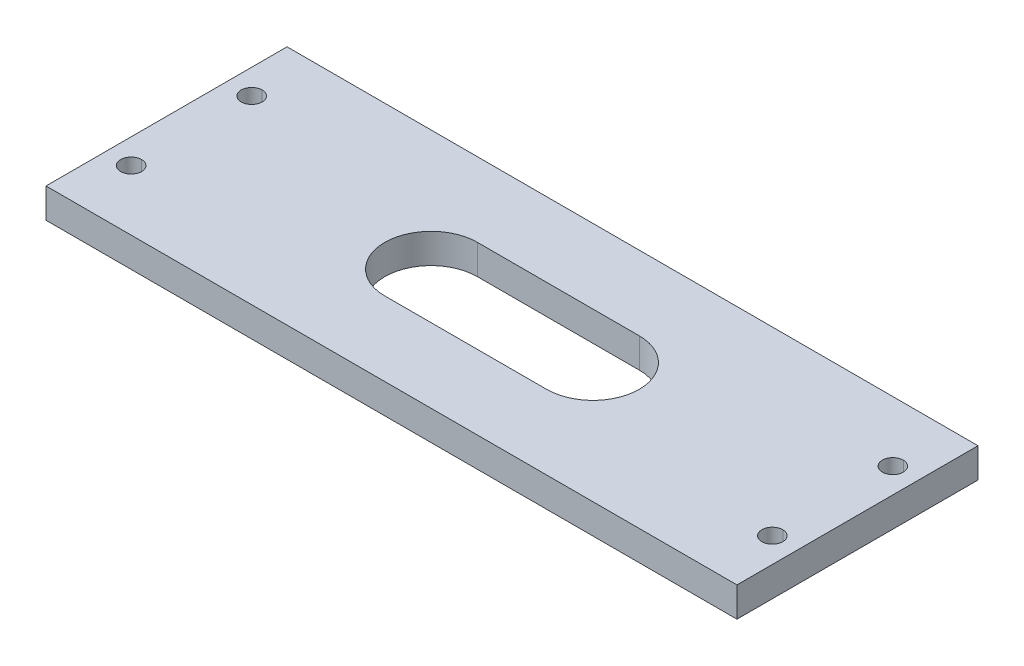
ISO-10303-21;
HEADER;
FILE_DESCRIPTION(('STEP AP214'),'2;1');
FILE_NAME('part.step','',(''),(''),'','','');
FILE_SCHEMA(('AUTOMOTIVE_DESIGN { 1 0 10303 214 1 1 1 1 }'));
ENDSEC;
DATA;
#1=APPLICATION_CONTEXT('core data for automotive mechanical design processes');
#2=APPLICATION_PROTOCOL_DEFINITION('international standard','automotive_design',2000,#1);
#3=PRODUCT_CONTEXT('',#1,'mechanical');
#4=PRODUCT('Part','Part','',(#3));
#5=PRODUCT_RELATED_PRODUCT_CATEGORY('part','',(#4));
#6=PRODUCT_DEFINITION_FORMATION('','',#4);
#7=PRODUCT_DEFINITION_CONTEXT('part definition',#1,'design');
#8=PRODUCT_DEFINITION('design','',#6,#7);
#9=PRODUCT_DEFINITION_SHAPE('','',#8);
#10=(LENGTH_UNIT() NAMED_UNIT(*) SI_UNIT(.MILLI.,.METRE.));
#11=(NAMED_UNIT(*) PLANE_ANGLE_UNIT() SI_UNIT($,.RADIAN.));
#12=(NAMED_UNIT(*) SI_UNIT($,.STERADIAN.) SOLID_ANGLE_UNIT());
#13=UNCERTAINTY_MEASURE_WITH_UNIT(LENGTH_MEASURE(1.E-05),#10,'distance_accuracy_value','');
#14=(GEOMETRIC_REPRESENTATION_CONTEXT(3) GLOBAL_UNCERTAINTY_ASSIGNED_CONTEXT((#13)) GLOBAL_UNIT_ASSIGNED_CONTEXT((#10,
#11,#12)) REPRESENTATION_CONTEXT('',''));
#15=CARTESIAN_POINT('',(0.,0.,0.));
#16=DIRECTION('',(0.,0.,1.));
#17=DIRECTION('',(1.,0.,0.));
#18=AXIS2_PLACEMENT_3D('',#15,#16,#17);
#19=CARTESIAN_POINT('',(-50.673,-45.1660267995308,-9.525));
#20=DIRECTION('',(0.,1.,0.));
#21=DIRECTION('',(0.,0.,1.));
#22=AXIS2_PLACEMENT_3D('',#19,#20,#21);
#23=CYLINDRICAL_SURFACE('',#22,1.651);
#24=DIRECTION('',(0.,1.,0.));
#25=VECTOR('',#24,1.);
#26=CARTESIAN_POINT('',(-50.673,-45.1660267995308,-11.176));
#27=LINE('',#26,#25);
#28=CARTESIAN_POINT('',(-50.673,-2.3495,-11.176));
#29=VERTEX_POINT('',#28);
#30=CARTESIAN_POINT('',(-50.673,2.3495,-11.176));
#31=VERTEX_POINT('',#30);
#32=EDGE_CURVE('E168',#29,#31,#27,.T.);
#33=ORIENTED_EDGE('',*,*,#32,.F.);
#34=CARTESIAN_POINT('',(-50.673,-2.3495,-9.525));
#35=DIRECTION('',(0.,-1.,0.));
#36=DIRECTION('',(0.,0.,1.));
#37=AXIS2_PLACEMENT_3D('',#34,#35,#36);
#38=CIRCLE('',#37,1.651);
#39=CARTESIAN_POINT('',(-50.673,-2.3495,-7.874));
#40=VERTEX_POINT('',#39);
#41=EDGE_CURVE('E163',#29,#40,#38,.T.);
#42=ORIENTED_EDGE('',*,*,#41,.T.);
#43=DIRECTION('',(0.,1.,0.));
#44=VECTOR('',#43,1.);
#45=CARTESIAN_POINT('',(-50.673,-45.1660267995308,-7.874));
#46=LINE('',#45,#44);
#47=CARTESIAN_POINT('',(-50.673,2.3495,-7.874));
#48=VERTEX_POINT('',#47);
#49=EDGE_CURVE('E165',#40,#48,#46,.T.);
#50=ORIENTED_EDGE('',*,*,#49,.T.);
#51=CARTESIAN_POINT('',(-50.673,2.3495,-9.525));
#52=DIRECTION('',(0.,1.,0.));
#53=DIRECTION('',(0.,0.,1.));
#54=AXIS2_PLACEMENT_3D('',#51,#52,#53);
#55=CIRCLE('',#54,1.651);
#56=EDGE_CURVE('E237',#48,#31,#55,.T.);
#57=ORIENTED_EDGE('',*,*,#56,.T.);
#58=EDGE_LOOP('',(#33,#42,#50,#57));
#59=FACE_BOUND('',#58,.T.);
#60=ADVANCED_FACE('F15',(#59),#23,.F.);
#61=CARTESIAN_POINT('',(50.673,-45.1660267995308,9.525));
#62=DIRECTION('',(0.,1.,0.));
#63=DIRECTION('',(0.,0.,1.));
#64=AXIS2_PLACEMENT_3D('',#61,#62,#63);
#65=CYLINDRICAL_SURFACE('',#64,1.651);
#66=DIRECTION('',(0.,1.,0.));
#67=VECTOR('',#66,1.);
#68=CARTESIAN_POINT('',(50.673,-45.1660267995308,7.874));
#69=LINE('',#68,#67);
#70=CARTESIAN_POINT('',(50.673,-2.3495,7.874));
#71=VERTEX_POINT('',#70);
#72=CARTESIAN_POINT('',(50.673,2.3495,7.874));
#73=VERTEX_POINT('',#72);
#74=EDGE_CURVE('E228',#71,#73,#69,.T.);
#75=ORIENTED_EDGE('',*,*,#74,.F.);
#76=CARTESIAN_POINT('',(50.673,-2.3495,9.525));
#77=DIRECTION('',(0.,-1.,0.));
#78=DIRECTION('',(0.,0.,1.));
#79=AXIS2_PLACEMENT_3D('',#76,#77,#78);
#80=CIRCLE('',#79,1.651);
#81=CARTESIAN_POINT('',(50.673,-2.3495,11.176));
#82=VERTEX_POINT('',#81);
#83=EDGE_CURVE('E173',#71,#82,#80,.T.);
#84=ORIENTED_EDGE('',*,*,#83,.T.);
#85=DIRECTION('',(0.,1.,0.));
#86=VECTOR('',#85,1.);
#87=CARTESIAN_POINT('',(50.673,-45.1660267995308,11.176));
#88=LINE('',#87,#86);
#89=CARTESIAN_POINT('',(50.673,2.3495,11.176));
#90=VERTEX_POINT('',#89);
#91=EDGE_CURVE('E198',#82,#90,#88,.T.);
#92=ORIENTED_EDGE('',*,*,#91,.T.);
#93=CARTESIAN_POINT('',(50.673,2.3495,9.525));
#94=DIRECTION('',(0.,1.,0.));
#95=DIRECTION('',(0.,0.,1.));
#96=AXIS2_PLACEMENT_3D('',#93,#94,#95);
#97=CIRCLE('',#96,1.651);
#98=EDGE_CURVE('E233',#90,#73,#97,.T.);
#99=ORIENTED_EDGE('',*,*,#98,.T.);
#100=EDGE_LOOP('',(#75,#84,#92,#99));
#101=FACE_BOUND('',#100,.T.);
#102=ADVANCED_FACE('F378',(#101),#65,.F.);
#103=CARTESIAN_POINT('',(50.673,-45.1660267995308,-9.525));
#104=DIRECTION('',(0.,1.,0.));
#105=DIRECTION('',(0.,0.,1.));
#106=AXIS2_PLACEMENT_3D('',#103,#104,#105);
#107=CYLINDRICAL_SURFACE('',#106,1.651);
#108=DIRECTION('',(0.,1.,0.));
#109=VECTOR('',#108,1.);
#110=CARTESIAN_POINT('',(50.673,-45.1660267995308,-11.176));
#111=LINE('',#110,#109);
#112=CARTESIAN_POINT('',(50.673,-2.3495,-11.176));
#113=VERTEX_POINT('',#112);
#114=CARTESIAN_POINT('',(50.673,2.3495,-11.176));
#115=VERTEX_POINT('',#114);
#116=EDGE_CURVE('E197',#113,#115,#111,.T.);
#117=ORIENTED_EDGE('',*,*,#116,.F.);
#118=CARTESIAN_POINT('',(50.673,-2.3495,-9.525));
#119=DIRECTION('',(0.,-1.,0.));
#120=DIRECTION('',(0.,0.,1.));
#121=AXIS2_PLACEMENT_3D('',#118,#119,#120);
#122=CIRCLE('',#121,1.651);
#123=CARTESIAN_POINT('',(50.673,-2.3495,-7.874));
#124=VERTEX_POINT('',#123);
#125=EDGE_CURVE('E276',#113,#124,#122,.T.);
#126=ORIENTED_EDGE('',*,*,#125,.T.);
#127=DIRECTION('',(0.,1.,0.));
#128=VECTOR('',#127,1.);
#129=CARTESIAN_POINT('',(50.673,-45.1660267995308,-7.874));
#130=LINE('',#129,#128);
#131=CARTESIAN_POINT('',(50.673,2.3495,-7.874));
#132=VERTEX_POINT('',#131);
#133=EDGE_CURVE('E227',#124,#132,#130,.T.);
#134=ORIENTED_EDGE('',*,*,#133,.T.);
#135=CARTESIAN_POINT('',(50.673,2.3495,-9.525));
#136=DIRECTION('',(0.,1.,0.));
#137=DIRECTION('',(0.,0.,1.));
#138=AXIS2_PLACEMENT_3D('',#135,#136,#137);
#139=CIRCLE('',#138,1.651);
#140=EDGE_CURVE('E236',#132,#115,#139,.T.);
#141=ORIENTED_EDGE('',*,*,#140,.T.);
#142=EDGE_LOOP('',(#117,#126,#134,#141));
#143=FACE_BOUND('',#142,.T.);
#144=ADVANCED_FACE('F383',(#143),#107,.F.);
#145=CARTESIAN_POINT('',(-12.7896226945569,-45.1660267995308,7.32609455319277));
#146=DIRECTION('',(0.,0.,1.));
#147=DIRECTION('',(1.,0.,0.));
#148=AXIS2_PLACEMENT_3D('',#145,#146,#147);
#149=PLANE('',#148);
#150=DIRECTION('',(-1.,0.,0.));
#151=VECTOR('',#150,1.);
#152=CARTESIAN_POINT('',(-12.7896226945569,-2.3495,7.32609455319277));
#153=LINE('',#152,#151);
#154=CARTESIAN_POINT('',(12.7896226945569,-2.3495,7.32609455319277));
#155=VERTEX_POINT('',#154);
#156=CARTESIAN_POINT('',(-12.7896226945569,-2.3495,7.32609455319277));
#157=VERTEX_POINT('',#156);
#158=EDGE_CURVE('E258',#155,#157,#153,.T.);
#159=ORIENTED_EDGE('',*,*,#158,.T.);
#160=DIRECTION('',(0.,1.,0.));
#161=VECTOR('',#160,1.);
#162=CARTESIAN_POINT('',(-12.7896226945569,-45.1660267995308,7.32609455319277));
#163=LINE('',#162,#161);
#164=CARTESIAN_POINT('',(-12.7896226945569,2.3495,7.32609455319277));
#165=VERTEX_POINT('',#164);
#166=EDGE_CURVE('E251',#157,#165,#163,.T.);
#167=ORIENTED_EDGE('',*,*,#166,.T.);
#168=DIRECTION('',(1.,0.,0.));
#169=VECTOR('',#168,1.);
#170=CARTESIAN_POINT('',(-12.7896226945569,2.3495,7.32609455319277));
#171=LINE('',#170,#169);
#172=CARTESIAN_POINT('',(12.7896226945569,2.3495,7.32609455319277));
#173=VERTEX_POINT('',#172);
#174=EDGE_CURVE('E19',#165,#173,#171,.T.);
#175=ORIENTED_EDGE('',*,*,#174,.T.);
#176=DIRECTION('',(0.,1.,0.));
#177=VECTOR('',#176,1.);
#178=CARTESIAN_POINT('',(12.7896226945569,-45.1660267995308,7.32609455319277));
#179=LINE('',#178,#177);
#180=EDGE_CURVE('E10',#155,#173,#179,.T.);
#181=ORIENTED_EDGE('',*,*,#180,.F.);
#182=EDGE_LOOP('',(#159,#167,#175,#181));
#183=FACE_BOUND('',#182,.T.);
#184=ADVANCED_FACE('F566',(#183),#149,.F.);
#185=CARTESIAN_POINT('',(12.7896226945569,-45.1660267995308,0.));
#186=DIRECTION('',(0.,1.,0.));
#187=DIRECTION('',(0.,0.,1.));
#188=AXIS2_PLACEMENT_3D('',#185,#186,#187);
#189=CYLINDRICAL_SURFACE('',#188,7.32609455319277);
#190=CARTESIAN_POINT('',(12.7896226945569,-2.3495,0.));
#191=DIRECTION('',(0.,-1.,0.));
#192=DIRECTION('',(0.,0.,1.));
#193=AXIS2_PLACEMENT_3D('',#190,#191,#192);
#194=CIRCLE('',#193,7.32609455319277);
#195=CARTESIAN_POINT('',(12.7896226945569,-2.3495,-7.32609455319277));
#196=VERTEX_POINT('',#195);
#197=EDGE_CURVE('E261',#196,#155,#194,.T.);
#198=ORIENTED_EDGE('',*,*,#197,.T.);
#199=ORIENTED_EDGE('',*,*,#180,.T.);
#200=CARTESIAN_POINT('',(12.7896226945569,2.3495,0.));
#201=DIRECTION('',(0.,1.,0.));
#202=DIRECTION('',(0.,0.,1.));
#203=AXIS2_PLACEMENT_3D('',#200,#201,#202);
#204=CIRCLE('',#203,7.32609455319277);
#205=CARTESIAN_POINT('',(12.7896226945569,2.3495,-7.32609455319277));
#206=VERTEX_POINT('',#205);
#207=EDGE_CURVE('E201',#173,#206,#204,.T.);
#208=ORIENTED_EDGE('',*,*,#207,.T.);
#209=DIRECTION('',(0.,1.,0.));
#210=VECTOR('',#209,1.);
#211=CARTESIAN_POINT('',(12.7896226945569,-45.1660267995308,-7.32609455319277));
#212=LINE('',#211,#210);
#213=EDGE_CURVE('E26',#196,#206,#212,.T.);
#214=ORIENTED_EDGE('',*,*,#213,.F.);
#215=EDGE_LOOP('',(#198,#199,#208,#214));
#216=FACE_BOUND('',#215,.T.);
#217=ADVANCED_FACE('F575',(#216),#189,.F.);
#218=CARTESIAN_POINT('',(-12.7896226945569,-45.1660267995308,-7.32609455319277));
#219=DIRECTION('',(0.,0.,-1.));
#220=DIRECTION('',(0.,-1.,0.));
#221=AXIS2_PLACEMENT_3D('',#218,#219,#220);
#222=PLANE('',#221);
#223=DIRECTION('',(1.,0.,0.));
#224=VECTOR('',#223,1.);
#225=CARTESIAN_POINT('',(-12.7896226945569,-2.3495,-7.32609455319277));
#226=LINE('',#225,#224);
#227=CARTESIAN_POINT('',(-12.7896226945569,-2.3495,-7.32609455319277));
#228=VERTEX_POINT('',#227);
#229=EDGE_CURVE('E294',#228,#196,#226,.T.);
#230=ORIENTED_EDGE('',*,*,#229,.T.);
#231=ORIENTED_EDGE('',*,*,#213,.T.);
#232=DIRECTION('',(-1.,0.,0.));
#233=VECTOR('',#232,1.);
#234=CARTESIAN_POINT('',(-12.7896226945569,2.3495,-7.32609455319277));
#235=LINE('',#234,#233);
#236=CARTESIAN_POINT('',(-12.7896226945569,2.3495,-7.32609455319277));
#237=VERTEX_POINT('',#236);
#238=EDGE_CURVE('E205',#206,#237,#235,.T.);
#239=ORIENTED_EDGE('',*,*,#238,.T.);
#240=DIRECTION('',(0.,1.,0.));
#241=VECTOR('',#240,1.);
#242=CARTESIAN_POINT('',(-12.7896226945569,-45.1660267995308,-7.32609455319277));
#243=LINE('',#242,#241);
#244=EDGE_CURVE('E248',#228,#237,#243,.T.);
#245=ORIENTED_EDGE('',*,*,#244,.F.);
#246=EDGE_LOOP('',(#230,#231,#239,#245));
#247=FACE_BOUND('',#246,.T.);
#248=ADVANCED_FACE('F601',(#247),#222,.F.);
#249=CARTESIAN_POINT('',(-12.7896226945569,-45.1660267995308,0.));
#250=DIRECTION('',(0.,1.,0.));
#251=DIRECTION('',(0.,0.,1.));
#252=AXIS2_PLACEMENT_3D('',#249,#250,#251);
#253=CYLINDRICAL_SURFACE('',#252,7.32609455319277);
#254=CARTESIAN_POINT('',(-12.7896226945569,-2.3495,0.));
#255=DIRECTION('',(0.,-1.,0.));
#256=DIRECTION('',(0.,0.,1.));
#257=AXIS2_PLACEMENT_3D('',#254,#255,#256);
#258=CIRCLE('',#257,7.32609455319277);
#259=EDGE_CURVE('E262',#157,#228,#258,.T.);
#260=ORIENTED_EDGE('',*,*,#259,.T.);
#261=ORIENTED_EDGE('',*,*,#244,.T.);
#262=CARTESIAN_POINT('',(-12.7896226945569,2.3495,0.));
#263=DIRECTION('',(0.,1.,0.));
#264=DIRECTION('',(0.,0.,1.));
#265=AXIS2_PLACEMENT_3D('',#262,#263,#264);
#266=CIRCLE('',#265,7.32609455319277);
#267=EDGE_CURVE('E283',#237,#165,#266,.T.);
#268=ORIENTED_EDGE('',*,*,#267,.T.);
#269=ORIENTED_EDGE('',*,*,#166,.F.);
#270=EDGE_LOOP('',(#260,#261,#268,#269));
#271=FACE_BOUND('',#270,.T.);
#272=ADVANCED_FACE('F370',(#271),#253,.F.);
#273=CARTESIAN_POINT('',(-50.673,-45.1660267995308,9.525));
#274=DIRECTION('',(0.,1.,0.));
#275=DIRECTION('',(0.,0.,1.));
#276=AXIS2_PLACEMENT_3D('',#273,#274,#275);
#277=CYLINDRICAL_SURFACE('',#276,1.651);
#278=DIRECTION('',(0.,1.,0.));
#279=VECTOR('',#278,1.);
#280=CARTESIAN_POINT('',(-50.673,-45.1660267995308,7.874));
#281=LINE('',#280,#279);
#282=CARTESIAN_POINT('',(-50.673,-2.3495,7.874));
#283=VERTEX_POINT('',#282);
#284=CARTESIAN_POINT('',(-50.673,2.3495,7.874));
#285=VERTEX_POINT('',#284);
#286=EDGE_CURVE('E226',#283,#285,#281,.T.);
#287=ORIENTED_EDGE('',*,*,#286,.F.);
#288=CARTESIAN_POINT('',(-50.673,-2.3495,9.525));
#289=DIRECTION('',(0.,-1.,0.));
#290=DIRECTION('',(0.,0.,1.));
#291=AXIS2_PLACEMENT_3D('',#288,#289,#290);
#292=CIRCLE('',#291,1.651);
#293=CARTESIAN_POINT('',(-50.673,-2.3495,11.176));
#294=VERTEX_POINT('',#293);
#295=EDGE_CURVE('E252',#283,#294,#292,.T.);
#296=ORIENTED_EDGE('',*,*,#295,.T.);
#297=DIRECTION('',(0.,1.,0.));
#298=VECTOR('',#297,1.);
#299=CARTESIAN_POINT('',(-50.673,-45.1660267995308,11.176));
#300=LINE('',#299,#298);
#301=CARTESIAN_POINT('',(-50.673,2.3495,11.176));
#302=VERTEX_POINT('',#301);
#303=EDGE_CURVE('E257',#294,#302,#300,.T.);
#304=ORIENTED_EDGE('',*,*,#303,.T.);
#305=CARTESIAN_POINT('',(-50.673,2.3495,9.525));
#306=DIRECTION('',(0.,1.,0.));
#307=DIRECTION('',(0.,0.,1.));
#308=AXIS2_PLACEMENT_3D('',#305,#306,#307);
#309=CIRCLE('',#308,1.651);
#310=EDGE_CURVE('E174',#302,#285,#309,.T.);
#311=ORIENTED_EDGE('',*,*,#310,.T.);
#312=EDGE_LOOP('',(#287,#296,#304,#311));
#313=FACE_BOUND('',#312,.T.);
#314=ADVANCED_FACE('F360',(#313),#277,.F.);
#315=CARTESIAN_POINT('',(0.,-2.3495,0.));
#316=DIRECTION('',(0.,1.,0.));
#317=DIRECTION('',(1.,0.,0.));
#318=AXIS2_PLACEMENT_3D('',#315,#316,#317);
#319=PLANE('',#318);
#320=CARTESIAN_POINT('',(-50.673,-2.3495,9.525));
#321=DIRECTION('',(0.,-1.,0.));
#322=DIRECTION('',(0.,0.,1.));
#323=AXIS2_PLACEMENT_3D('',#320,#321,#322);
#324=CIRCLE('',#323,1.651);
#325=EDGE_CURVE('E222',#294,#283,#324,.T.);
#326=ORIENTED_EDGE('',*,*,#325,.F.);
#327=ORIENTED_EDGE('',*,*,#295,.F.);
#328=EDGE_LOOP('',(#326,#327));
#329=FACE_BOUND('',#328,.T.);
#330=ORIENTED_EDGE('',*,*,#229,.F.);
#331=ORIENTED_EDGE('',*,*,#259,.F.);
#332=ORIENTED_EDGE('',*,*,#158,.F.);
#333=ORIENTED_EDGE('',*,*,#197,.F.);
#334=EDGE_LOOP('',(#330,#331,#332,#333));
#335=FACE_BOUND('',#334,.T.);
#336=CARTESIAN_POINT('',(50.673,-2.3495,-9.525));
#337=DIRECTION('',(0.,-1.,0.));
#338=DIRECTION('',(0.,0.,1.));
#339=AXIS2_PLACEMENT_3D('',#336,#337,#338);
#340=CIRCLE('',#339,1.651);
#341=EDGE_CURVE('E193',#124,#113,#340,.T.);
#342=ORIENTED_EDGE('',*,*,#341,.F.);
#343=ORIENTED_EDGE('',*,*,#125,.F.);
#344=EDGE_LOOP('',(#342,#343));
#345=FACE_BOUND('',#344,.T.);
#346=CARTESIAN_POINT('',(50.673,-2.3495,9.525));
#347=DIRECTION('',(0.,-1.,0.));
#348=DIRECTION('',(0.,0.,1.));
#349=AXIS2_PLACEMENT_3D('',#346,#347,#348);
#350=CIRCLE('',#349,1.651);
#351=EDGE_CURVE('E182',#82,#71,#350,.T.);
#352=ORIENTED_EDGE('',*,*,#351,.F.);
#353=ORIENTED_EDGE('',*,*,#83,.F.);
#354=EDGE_LOOP('',(#352,#353));
#355=FACE_BOUND('',#354,.T.);
#356=CARTESIAN_POINT('',(-50.673,-2.3495,-9.525));
#357=DIRECTION('',(0.,-1.,0.));
#358=DIRECTION('',(0.,0.,1.));
#359=AXIS2_PLACEMENT_3D('',#356,#357,#358);
#360=CIRCLE('',#359,1.651);
#361=EDGE_CURVE('E178',#40,#29,#360,.T.);
#362=ORIENTED_EDGE('',*,*,#361,.F.);
#363=ORIENTED_EDGE('',*,*,#41,.F.);
#364=EDGE_LOOP('',(#362,#363));
#365=FACE_BOUND('',#364,.T.);
#366=DIRECTION('',(0.,0.,1.));
#367=VECTOR('',#366,1.);
#368=CARTESIAN_POINT('',(-54.61,-2.3495,19.05));
#369=LINE('',#368,#367);
#370=CARTESIAN_POINT('',(-54.61,-2.3495,-19.05));
#371=VERTEX_POINT('',#370);
#372=CARTESIAN_POINT('',(-54.61,-2.3495,19.05));
#373=VERTEX_POINT('',#372);
#374=EDGE_CURVE('E269',#371,#373,#369,.T.);
#375=ORIENTED_EDGE('',*,*,#374,.F.);
#376=DIRECTION('',(-1.,0.,0.));
#377=VECTOR('',#376,1.);
#378=CARTESIAN_POINT('',(54.61,-2.3495,-19.05));
#379=LINE('',#378,#377);
#380=CARTESIAN_POINT('',(54.61,-2.3495,-19.05));
#381=VERTEX_POINT('',#380);
#382=EDGE_CURVE('E212',#381,#371,#379,.T.);
#383=ORIENTED_EDGE('',*,*,#382,.F.);
#384=DIRECTION('',(0.,0.,-1.));
#385=VECTOR('',#384,1.);
#386=CARTESIAN_POINT('',(54.61,-2.3495,19.05));
#387=LINE('',#386,#385);
#388=CARTESIAN_POINT('',(54.61,-2.3495,19.05));
#389=VERTEX_POINT('',#388);
#390=EDGE_CURVE('E217',#389,#381,#387,.T.);
#391=ORIENTED_EDGE('',*,*,#390,.F.);
#392=DIRECTION('',(1.,0.,0.));
#393=VECTOR('',#392,1.);
#394=CARTESIAN_POINT('',(54.61,-2.3495,19.05));
#395=LINE('',#394,#393);
#396=EDGE_CURVE('E238',#373,#389,#395,.T.);
#397=ORIENTED_EDGE('',*,*,#396,.F.);
#398=EDGE_LOOP('',(#375,#383,#391,#397));
#399=FACE_BOUND('',#398,.T.);
#400=ADVANCED_FACE('F184',(#329,#335,#345,#355,#365,#399),#319,.F.);
#401=CARTESIAN_POINT('',(0.,2.3495,0.));
#402=DIRECTION('',(0.,1.,0.));
#403=DIRECTION('',(1.,0.,0.));
#404=AXIS2_PLACEMENT_3D('',#401,#402,#403);
#405=PLANE('',#404);
#406=ORIENTED_EDGE('',*,*,#310,.F.);
#407=CARTESIAN_POINT('',(-50.673,2.3495,9.525));
#408=DIRECTION('',(0.,1.,0.));
#409=DIRECTION('',(0.,0.,1.));
#410=AXIS2_PLACEMENT_3D('',#407,#408,#409);
#411=CIRCLE('',#410,1.651);
#412=EDGE_CURVE('E253',#285,#302,#411,.T.);
#413=ORIENTED_EDGE('',*,*,#412,.F.);
#414=EDGE_LOOP('',(#406,#413));
#415=FACE_BOUND('',#414,.T.);
#416=ORIENTED_EDGE('',*,*,#267,.F.);
#417=ORIENTED_EDGE('',*,*,#238,.F.);
#418=ORIENTED_EDGE('',*,*,#207,.F.);
#419=ORIENTED_EDGE('',*,*,#174,.F.);
#420=EDGE_LOOP('',(#416,#417,#418,#419));
#421=FACE_BOUND('',#420,.T.);
#422=ORIENTED_EDGE('',*,*,#140,.F.);
#423=CARTESIAN_POINT('',(50.673,2.3495,-9.525));
#424=DIRECTION('',(0.,1.,0.));
#425=DIRECTION('',(0.,0.,1.));
#426=AXIS2_PLACEMENT_3D('',#423,#424,#425);
#427=CIRCLE('',#426,1.651);
#428=EDGE_CURVE('E221',#115,#132,#427,.T.);
#429=ORIENTED_EDGE('',*,*,#428,.F.);
#430=EDGE_LOOP('',(#422,#429));
#431=FACE_BOUND('',#430,.T.);
#432=ORIENTED_EDGE('',*,*,#98,.F.);
#433=CARTESIAN_POINT('',(50.673,2.3495,9.525));
#434=DIRECTION('',(0.,1.,0.));
#435=DIRECTION('',(0.,0.,1.));
#436=AXIS2_PLACEMENT_3D('',#433,#434,#435);
#437=CIRCLE('',#436,1.651);
#438=EDGE_CURVE('E232',#73,#90,#437,.T.);
#439=ORIENTED_EDGE('',*,*,#438,.F.);
#440=EDGE_LOOP('',(#432,#439));
#441=FACE_BOUND('',#440,.T.);
#442=ORIENTED_EDGE('',*,*,#56,.F.);
#443=CARTESIAN_POINT('',(-50.673,2.3495,-9.525));
#444=DIRECTION('',(0.,1.,0.));
#445=DIRECTION('',(0.,0.,1.));
#446=AXIS2_PLACEMENT_3D('',#443,#444,#445);
#447=CIRCLE('',#446,1.651);
#448=EDGE_CURVE('E180',#31,#48,#447,.T.);
#449=ORIENTED_EDGE('',*,*,#448,.F.);
#450=EDGE_LOOP('',(#442,#449));
#451=FACE_BOUND('',#450,.T.);
#452=DIRECTION('',(0.,0.,1.));
#453=VECTOR('',#452,1.);
#454=CARTESIAN_POINT('',(-54.61,2.3495,19.05));
#455=LINE('',#454,#453);
#456=CARTESIAN_POINT('',(-54.61,2.3495,-19.05));
#457=VERTEX_POINT('',#456);
#458=CARTESIAN_POINT('',(-54.61,2.3495,19.05));
#459=VERTEX_POINT('',#458);
#460=EDGE_CURVE('E327',#457,#459,#455,.T.);
#461=ORIENTED_EDGE('',*,*,#460,.T.);
#462=DIRECTION('',(1.,0.,0.));
#463=VECTOR('',#462,1.);
#464=CARTESIAN_POINT('',(54.61,2.3495,19.05));
#465=LINE('',#464,#463);
#466=CARTESIAN_POINT('',(54.61,2.3495,19.05));
#467=VERTEX_POINT('',#466);
#468=EDGE_CURVE('E247',#459,#467,#465,.T.);
#469=ORIENTED_EDGE('',*,*,#468,.T.);
#470=DIRECTION('',(0.,0.,-1.));
#471=VECTOR('',#470,1.);
#472=CARTESIAN_POINT('',(54.61,2.3495,19.05));
#473=LINE('',#472,#471);
#474=CARTESIAN_POINT('',(54.61,2.3495,-19.05));
#475=VERTEX_POINT('',#474);
#476=EDGE_CURVE('E208',#467,#475,#473,.T.);
#477=ORIENTED_EDGE('',*,*,#476,.T.);
#478=DIRECTION('',(-1.,0.,0.));
#479=VECTOR('',#478,1.);
#480=CARTESIAN_POINT('',(54.61,2.3495,-19.05));
#481=LINE('',#480,#479);
#482=EDGE_CURVE('E265',#475,#457,#481,.T.);
#483=ORIENTED_EDGE('',*,*,#482,.T.);
#484=EDGE_LOOP('',(#461,#469,#477,#483));
#485=FACE_BOUND('',#484,.T.);
#486=ADVANCED_FACE('F345',(#415,#421,#431,#441,#451,#485),#405,.T.);
#487=CARTESIAN_POINT('',(54.61,2.3495,-19.05));
#488=DIRECTION('',(0.,0.,1.));
#489=DIRECTION('',(1.,0.,0.));
#490=AXIS2_PLACEMENT_3D('',#487,#488,#489);
#491=PLANE('',#490);
#492=ORIENTED_EDGE('',*,*,#382,.T.);
#493=DIRECTION('',(0.,-1.,0.));
#494=VECTOR('',#493,1.);
#495=CARTESIAN_POINT('',(-54.61,2.3495,-19.05));
#496=LINE('',#495,#494);
#497=EDGE_CURVE('E243',#457,#371,#496,.T.);
#498=ORIENTED_EDGE('',*,*,#497,.F.);
#499=ORIENTED_EDGE('',*,*,#482,.F.);
#500=DIRECTION('',(0.,-1.,0.));
#501=VECTOR('',#500,1.);
#502=CARTESIAN_POINT('',(54.61,2.3495,-19.05));
#503=LINE('',#502,#501);
#504=EDGE_CURVE('E213',#475,#381,#503,.T.);
#505=ORIENTED_EDGE('',*,*,#504,.T.);
#506=EDGE_LOOP('',(#492,#498,#499,#505));
#507=FACE_BOUND('',#506,.T.);
#508=ADVANCED_FACE('F354',(#507),#491,.F.);
#509=CARTESIAN_POINT('',(54.61,2.3495,19.05));
#510=DIRECTION('',(-1.,0.,0.));
#511=DIRECTION('',(0.,0.,1.));
#512=AXIS2_PLACEMENT_3D('',#509,#510,#511);
#513=PLANE('',#512);
#514=ORIENTED_EDGE('',*,*,#390,.T.);
#515=ORIENTED_EDGE('',*,*,#504,.F.);
#516=ORIENTED_EDGE('',*,*,#476,.F.);
#517=DIRECTION('',(0.,-1.,0.));
#518=VECTOR('',#517,1.);
#519=CARTESIAN_POINT('',(54.61,2.3495,19.05));
#520=LINE('',#519,#518);
#521=EDGE_CURVE('E242',#467,#389,#520,.T.);
#522=ORIENTED_EDGE('',*,*,#521,.T.);
#523=EDGE_LOOP('',(#514,#515,#516,#522));
#524=FACE_BOUND('',#523,.T.);
#525=ADVANCED_FACE('F352',(#524),#513,.F.);
#526=CARTESIAN_POINT('',(54.61,2.3495,19.05));
#527=DIRECTION('',(0.,0.,-1.));
#528=DIRECTION('',(-1.,0.,0.));
#529=AXIS2_PLACEMENT_3D('',#526,#527,#528);
#530=PLANE('',#529);
#531=ORIENTED_EDGE('',*,*,#396,.T.);
#532=ORIENTED_EDGE('',*,*,#521,.F.);
#533=ORIENTED_EDGE('',*,*,#468,.F.);
#534=DIRECTION('',(0.,-1.,0.));
#535=VECTOR('',#534,1.);
#536=CARTESIAN_POINT('',(-54.61,2.3495,19.05));
#537=LINE('',#536,#535);
#538=EDGE_CURVE('E273',#459,#373,#537,.T.);
#539=ORIENTED_EDGE('',*,*,#538,.T.);
#540=EDGE_LOOP('',(#531,#532,#533,#539));
#541=FACE_BOUND('',#540,.T.);
#542=ADVANCED_FACE('F350',(#541),#530,.F.);
#543=CARTESIAN_POINT('',(-54.61,2.3495,19.05));
#544=DIRECTION('',(1.,0.,0.));
#545=DIRECTION('',(0.,1.,0.));
#546=AXIS2_PLACEMENT_3D('',#543,#544,#545);
#547=PLANE('',#546);
#548=ORIENTED_EDGE('',*,*,#374,.T.);
#549=ORIENTED_EDGE('',*,*,#538,.F.);
#550=ORIENTED_EDGE('',*,*,#460,.F.);
#551=ORIENTED_EDGE('',*,*,#497,.T.);
#552=EDGE_LOOP('',(#548,#549,#550,#551));
#553=FACE_BOUND('',#552,.T.);
#554=ADVANCED_FACE('F358',(#553),#547,.F.);
#555=CARTESIAN_POINT('',(-50.673,-45.1660267995308,9.525));
#556=DIRECTION('',(0.,1.,0.));
#557=DIRECTION('',(0.,0.,1.));
#558=AXIS2_PLACEMENT_3D('',#555,#556,#557);
#559=CYLINDRICAL_SURFACE('',#558,1.651);
#560=ORIENTED_EDGE('',*,*,#325,.T.);
#561=ORIENTED_EDGE('',*,*,#286,.T.);
#562=ORIENTED_EDGE('',*,*,#412,.T.);
#563=ORIENTED_EDGE('',*,*,#303,.F.);
#564=EDGE_LOOP('',(#560,#561,#562,#563));
#565=FACE_BOUND('',#564,.T.);
#566=ADVANCED_FACE('F17',(#565),#559,.F.);
#567=CARTESIAN_POINT('',(50.673,-45.1660267995308,-9.525));
#568=DIRECTION('',(0.,1.,0.));
#569=DIRECTION('',(0.,0.,1.));
#570=AXIS2_PLACEMENT_3D('',#567,#568,#569);
#571=CYLINDRICAL_SURFACE('',#570,1.651);
#572=ORIENTED_EDGE('',*,*,#341,.T.);
#573=ORIENTED_EDGE('',*,*,#116,.T.);
#574=ORIENTED_EDGE('',*,*,#428,.T.);
#575=ORIENTED_EDGE('',*,*,#133,.F.);
#576=EDGE_LOOP('',(#572,#573,#574,#575));
#577=FACE_BOUND('',#576,.T.);
#578=ADVANCED_FACE('F388',(#577),#571,.F.);
#579=CARTESIAN_POINT('',(50.673,-45.1660267995308,9.525));
#580=DIRECTION('',(0.,1.,0.));
#581=DIRECTION('',(0.,0.,1.));
#582=AXIS2_PLACEMENT_3D('',#579,#580,#581);
#583=CYLINDRICAL_SURFACE('',#582,1.651);
#584=ORIENTED_EDGE('',*,*,#351,.T.);
#585=ORIENTED_EDGE('',*,*,#74,.T.);
#586=ORIENTED_EDGE('',*,*,#438,.T.);
#587=ORIENTED_EDGE('',*,*,#91,.F.);
#588=EDGE_LOOP('',(#584,#585,#586,#587));
#589=FACE_BOUND('',#588,.T.);
#590=ADVANCED_FACE('F390',(#589),#583,.F.);
#591=CARTESIAN_POINT('',(-50.673,-45.1660267995308,-9.525));
#592=DIRECTION('',(0.,1.,0.));
#593=DIRECTION('',(0.,0.,1.));
#594=AXIS2_PLACEMENT_3D('',#591,#592,#593);
#595=CYLINDRICAL_SURFACE('',#594,1.651);
#596=ORIENTED_EDGE('',*,*,#361,.T.);
#597=ORIENTED_EDGE('',*,*,#32,.T.);
#598=ORIENTED_EDGE('',*,*,#448,.T.);
#599=ORIENTED_EDGE('',*,*,#49,.F.);
#600=EDGE_LOOP('',(#596,#597,#598,#599));
#601=FACE_BOUND('',#600,.T.);
#602=ADVANCED_FACE('F177',(#601),#595,.F.);
#603=CLOSED_SHELL('',(#60,#102,#144,#184,#217,#248,#272,#314,#400,#486,#508,#525,#542,#554,#566,
#578,#590,#602));
#604=MANIFOLD_SOLID_BREP('B1',#603);
#605=ADVANCED_BREP_SHAPE_REPRESENTATION('',(#18,#604),#14);
#606=SHAPE_DEFINITION_REPRESENTATION(#9,#605);
ENDSEC;
END-ISO-10303-21;
